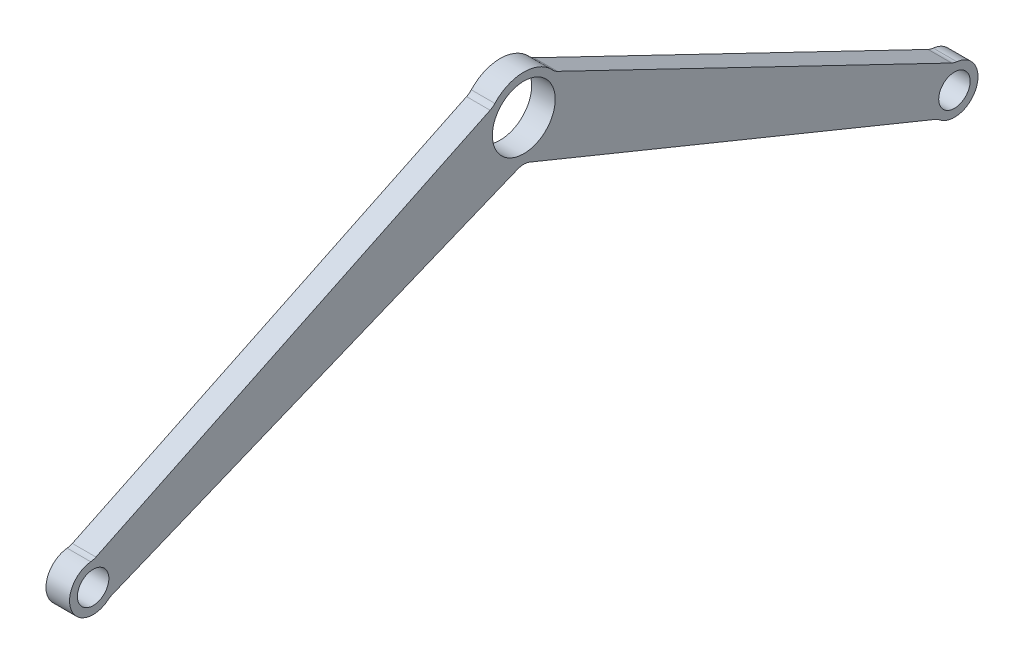
ISO-10303-21;
HEADER;
FILE_DESCRIPTION(('STEP AP214'),'2;1');
FILE_NAME('part.step','',(''),(''),'','','');
FILE_SCHEMA(('AUTOMOTIVE_DESIGN { 1 0 10303 214 1 1 1 1 }'));
ENDSEC;
DATA;
#1=APPLICATION_CONTEXT('core data for automotive mechanical design processes');
#2=APPLICATION_PROTOCOL_DEFINITION('international standard','automotive_design',2000,#1);
#3=PRODUCT_CONTEXT('',#1,'mechanical');
#4=PRODUCT('Part','Part','',(#3));
#5=PRODUCT_RELATED_PRODUCT_CATEGORY('part','',(#4));
#6=PRODUCT_DEFINITION_FORMATION('','',#4);
#7=PRODUCT_DEFINITION_CONTEXT('part definition',#1,'design');
#8=PRODUCT_DEFINITION('design','',#6,#7);
#9=PRODUCT_DEFINITION_SHAPE('','',#8);
#10=(LENGTH_UNIT() NAMED_UNIT(*) SI_UNIT(.MILLI.,.METRE.));
#11=(NAMED_UNIT(*) PLANE_ANGLE_UNIT() SI_UNIT($,.RADIAN.));
#12=(NAMED_UNIT(*) SI_UNIT($,.STERADIAN.) SOLID_ANGLE_UNIT());
#13=UNCERTAINTY_MEASURE_WITH_UNIT(LENGTH_MEASURE(1.E-05),#10,'distance_accuracy_value','');
#14=(GEOMETRIC_REPRESENTATION_CONTEXT(3) GLOBAL_UNCERTAINTY_ASSIGNED_CONTEXT((#13)) GLOBAL_UNIT_ASSIGNED_CONTEXT((#10,
#11,#12)) REPRESENTATION_CONTEXT('',''));
#15=CARTESIAN_POINT('',(0.,0.,0.));
#16=DIRECTION('',(0.,0.,1.));
#17=DIRECTION('',(1.,0.,0.));
#18=AXIS2_PLACEMENT_3D('',#15,#16,#17);
#19=CARTESIAN_POINT('',(30.,-42.8423665530146,-17.5114235797055));
#20=DIRECTION('',(0.,-0.925660483687346,-0.378355215293391));
#21=DIRECTION('',(0.,0.378355215293391,-0.925660483687346));
#22=AXIS2_PLACEMENT_3D('',#19,#20,#21);
#23=PLANE('',#22);
#24=DIRECTION('',(0.,-0.378355215293391,0.925660483687346));
#25=VECTOR('',#24,1.);
#26=CARTESIAN_POINT('',(0.,-42.8423665530146,-17.5114235797055));
#27=LINE('',#26,#25);
#28=CARTESIAN_POINT('',(0.,-53.0929843384793,7.56710430586782));
#29=VERTEX_POINT('',#28);
#30=CARTESIAN_POINT('',(0.,-264.160483712007,523.9518022392));
#31=VERTEX_POINT('',#30);
#32=EDGE_CURVE('E461',#29,#31,#27,.T.);
#33=ORIENTED_EDGE('',*,*,#32,.F.);
#34=DIRECTION('',(-1.,0.,0.));
#35=VECTOR('',#34,1.);
#36=CARTESIAN_POINT('',(30.,-53.0929843384793,7.56710430586782));
#37=LINE('',#36,#35);
#38=CARTESIAN_POINT('',(30.,-53.0929843384793,7.56710430586782));
#39=VERTEX_POINT('',#38);
#40=EDGE_CURVE('E341',#29,#39,#37,.F.);
#41=ORIENTED_EDGE('',*,*,#40,.T.);
#42=DIRECTION('',(0.,-0.378355215293391,0.925660483687346));
#43=VECTOR('',#42,1.);
#44=CARTESIAN_POINT('',(30.,-42.8423665530146,-17.5114235797055));
#45=LINE('',#44,#43);
#46=CARTESIAN_POINT('',(30.,-264.160483712007,523.9518022392));
#47=VERTEX_POINT('',#46);
#48=EDGE_CURVE('E318',#39,#47,#45,.T.);
#49=ORIENTED_EDGE('',*,*,#48,.T.);
#50=DIRECTION('',(-1.,0.,0.));
#51=VECTOR('',#50,1.);
#52=CARTESIAN_POINT('',(30.,-264.160483712007,523.9518022392));
#53=LINE('',#52,#51);
#54=EDGE_CURVE('E337',#47,#31,#53,.T.);
#55=ORIENTED_EDGE('',*,*,#54,.T.);
#56=EDGE_LOOP('',(#33,#41,#49,#55));
#57=FACE_BOUND('',#56,.T.);
#58=ADVANCED_FACE('F179',(#57),#23,.T.);
#59=CARTESIAN_POINT('',(30.,40.5827407099701,19.5493783012617));
#60=DIRECTION('',(0.,-0.900918872151872,-0.433987541066098));
#61=DIRECTION('',(0.,0.433987541066098,-0.900918872151872));
#62=AXIS2_PLACEMENT_3D('',#59,#60,#61);
#63=PLANE('',#62);
#64=DIRECTION('',(0.,-0.433987541066098,0.900918872151873));
#65=VECTOR('',#64,1.);
#66=CARTESIAN_POINT('',(0.,40.5827407099701,19.5493783012617));
#67=LINE('',#66,#65);
#68=CARTESIAN_POINT('',(0.,29.3574264870438,42.8521150674512));
#69=VERTEX_POINT('',#68);
#70=CARTESIAN_POINT('',(0.,-212.322113320347,544.556974821239));
#71=VERTEX_POINT('',#70);
#72=EDGE_CURVE('E395',#69,#71,#67,.T.);
#73=ORIENTED_EDGE('',*,*,#72,.T.);
#74=DIRECTION('',(1.,0.,0.));
#75=VECTOR('',#74,1.);
#76=CARTESIAN_POINT('',(30.,-212.322113320347,544.556974821239));
#77=LINE('',#76,#75);
#78=CARTESIAN_POINT('',(30.,-212.322113320347,544.556974821239));
#79=VERTEX_POINT('',#78);
#80=EDGE_CURVE('E195',#71,#79,#77,.T.);
#81=ORIENTED_EDGE('',*,*,#80,.T.);
#82=DIRECTION('',(0.,-0.433987541066098,0.900918872151873));
#83=VECTOR('',#82,1.);
#84=CARTESIAN_POINT('',(30.,40.5827407099701,19.5493783012617));
#85=LINE('',#84,#83);
#86=CARTESIAN_POINT('',(30.,29.3574264870438,42.8521150674512));
#87=VERTEX_POINT('',#86);
#88=EDGE_CURVE('E312',#87,#79,#85,.T.);
#89=ORIENTED_EDGE('',*,*,#88,.F.);
#90=DIRECTION('',(1.,0.,0.));
#91=VECTOR('',#90,1.);
#92=CARTESIAN_POINT('',(0.,29.3574264870438,42.8521150674512));
#93=LINE('',#92,#91);
#94=EDGE_CURVE('E357',#87,#69,#93,.F.);
#95=ORIENTED_EDGE('',*,*,#94,.T.);
#96=EDGE_LOOP('',(#73,#81,#89,#95));
#97=FACE_BOUND('',#96,.T.);
#98=ADVANCED_FACE('F406',(#97),#63,.F.);
#99=CARTESIAN_POINT('',(0.,0.,0.));
#100=DIRECTION('',(1.,0.,0.));
#101=DIRECTION('',(0.,0.,-1.));
#102=AXIS2_PLACEMENT_3D('',#99,#100,#101);
#103=PLANE('',#102);
#104=DIRECTION('',(0.,-0.378355215293391,-0.925660483687346));
#105=VECTOR('',#104,1.);
#106=CARTESIAN_POINT('',(0.,-42.8423665530146,17.5114235797055));
#107=LINE('',#106,#105);
#108=CARTESIAN_POINT('',(0.,-53.0929843384793,-7.56710430586782));
#109=VERTEX_POINT('',#108);
#110=CARTESIAN_POINT('',(0.,-264.160483712007,-523.9518022392));
#111=VERTEX_POINT('',#110);
#112=EDGE_CURVE('E307',#109,#111,#107,.T.);
#113=ORIENTED_EDGE('',*,*,#112,.F.);
#114=CARTESIAN_POINT('',(0.,-71.6061940122262,0.));
#115=DIRECTION('',(1.,0.,0.));
#116=DIRECTION('',(0.,0.,-1.));
#117=AXIS2_PLACEMENT_3D('',#114,#115,#116);
#118=CIRCLE('',#117,20.);
#119=EDGE_CURVE('E375',#109,#29,#118,.T.);
#120=ORIENTED_EDGE('',*,*,#119,.T.);
#121=ORIENTED_EDGE('',*,*,#32,.T.);
#122=CARTESIAN_POINT('',(0.,-282.673693385754,516.384697933332));
#123=DIRECTION('',(1.,0.,0.));
#124=DIRECTION('',(0.,0.,-1.));
#125=AXIS2_PLACEMENT_3D('',#122,#123,#124);
#126=CIRCLE('',#125,20.);
#127=CARTESIAN_POINT('',(0.,-267.221010369644,529.081728594224));
#128=VERTEX_POINT('',#127);
#129=EDGE_CURVE('E382',#31,#128,#126,.T.);
#130=ORIENTED_EDGE('',*,*,#129,.T.);
#131=CARTESIAN_POINT('',(0.,-244.041985845479,548.127274585561));
#132=DIRECTION('',(1.,0.,0.));
#133=DIRECTION('',(0.,0.,-1.));
#134=AXIS2_PLACEMENT_3D('',#131,#132,#133);
#135=CIRCLE('',#134,30.);
#136=CARTESIAN_POINT('',(0.,-214.199035864577,551.192945219761));
#137=VERTEX_POINT('',#136);
#138=EDGE_CURVE('E419',#137,#128,#135,.T.);
#139=ORIENTED_EDGE('',*,*,#138,.F.);
#140=CARTESIAN_POINT('',(0.,-194.303735877309,553.236725642561));
#141=DIRECTION('',(1.,0.,0.));
#142=DIRECTION('',(0.,0.,-1.));
#143=AXIS2_PLACEMENT_3D('',#140,#141,#142);
#144=CIRCLE('',#143,20.);
#145=EDGE_CURVE('E388',#137,#71,#144,.T.);
#146=ORIENTED_EDGE('',*,*,#145,.T.);
#147=ORIENTED_EDGE('',*,*,#72,.F.);
#148=CARTESIAN_POINT('',(0.,47.3758039300812,51.5318658887731));
#149=DIRECTION('',(1.,0.,0.));
#150=DIRECTION('',(0.,0.,-1.));
#151=AXIS2_PLACEMENT_3D('',#148,#149,#150);
#152=CIRCLE('',#151,20.);
#153=CARTESIAN_POINT('',(0.,33.839859950058,36.8084756348379));
#154=VERTEX_POINT('',#153);
#155=EDGE_CURVE('E188',#69,#154,#152,.T.);
#156=ORIENTED_EDGE('',*,*,#155,.T.);
#157=CARTESIAN_POINT('',(0.,0.,0.));
#158=DIRECTION('',(1.,0.,0.));
#159=DIRECTION('',(0.,0.,-1.));
#160=AXIS2_PLACEMENT_3D('',#157,#158,#159);
#161=CIRCLE('',#160,50.);
#162=CARTESIAN_POINT('',(0.,33.839859950058,-36.8084756348379));
#163=VERTEX_POINT('',#162);
#164=EDGE_CURVE('E288',#163,#154,#161,.T.);
#165=ORIENTED_EDGE('',*,*,#164,.F.);
#166=CARTESIAN_POINT('',(0.,47.3758039300812,-51.5318658887731));
#167=DIRECTION('',(1.,0.,0.));
#168=DIRECTION('',(0.,0.,-1.));
#169=AXIS2_PLACEMENT_3D('',#166,#167,#168);
#170=CIRCLE('',#169,20.);
#171=CARTESIAN_POINT('',(0.,29.3574264870438,-42.8521150674512));
#172=VERTEX_POINT('',#171);
#173=EDGE_CURVE('E281',#163,#172,#170,.T.);
#174=ORIENTED_EDGE('',*,*,#173,.T.);
#175=DIRECTION('',(0.,-0.433987541066098,-0.900918872151873));
#176=VECTOR('',#175,1.);
#177=CARTESIAN_POINT('',(0.,40.5827407099701,-19.5493783012617));
#178=LINE('',#177,#176);
#179=CARTESIAN_POINT('',(0.,-212.322113320347,-544.556974821239));
#180=VERTEX_POINT('',#179);
#181=EDGE_CURVE('E286',#172,#180,#178,.T.);
#182=ORIENTED_EDGE('',*,*,#181,.T.);
#183=CARTESIAN_POINT('',(0.,-194.303735877309,-553.236725642561));
#184=DIRECTION('',(1.,0.,0.));
#185=DIRECTION('',(0.,0.,-1.));
#186=AXIS2_PLACEMENT_3D('',#183,#184,#185);
#187=CIRCLE('',#186,20.);
#188=CARTESIAN_POINT('',(0.,-214.199035864577,-551.192945219761));
#189=VERTEX_POINT('',#188);
#190=EDGE_CURVE('E363',#180,#189,#187,.T.);
#191=ORIENTED_EDGE('',*,*,#190,.T.);
#192=CARTESIAN_POINT('',(0.,-244.041985845479,-548.127274585561));
#193=DIRECTION('',(-1.,0.,0.));
#194=DIRECTION('',(0.,0.,1.));
#195=AXIS2_PLACEMENT_3D('',#192,#193,#194);
#196=CIRCLE('',#195,30.);
#197=CARTESIAN_POINT('',(0.,-267.221010369644,-529.081728594224));
#198=VERTEX_POINT('',#197);
#199=EDGE_CURVE('E321',#189,#198,#196,.T.);
#200=ORIENTED_EDGE('',*,*,#199,.T.);
#201=CARTESIAN_POINT('',(0.,-282.673693385754,-516.384697933332));
#202=DIRECTION('',(1.,0.,0.));
#203=DIRECTION('',(0.,0.,-1.));
#204=AXIS2_PLACEMENT_3D('',#201,#202,#203);
#205=CIRCLE('',#204,20.);
#206=EDGE_CURVE('E369',#198,#111,#205,.T.);
#207=ORIENTED_EDGE('',*,*,#206,.T.);
#208=EDGE_LOOP('',(#113,#120,#121,#130,#139,#146,#147,#156,#165,#174,#182,#191,#200,#207));
#209=FACE_BOUND('',#208,.T.);
#210=CARTESIAN_POINT('',(0.,0.,0.));
#211=DIRECTION('',(1.,0.,0.));
#212=DIRECTION('',(0.,0.,-1.));
#213=AXIS2_PLACEMENT_3D('',#210,#211,#212);
#214=CIRCLE('',#213,40.);
#215=CARTESIAN_POINT('',(0.,0.,-40.));
#216=VERTEX_POINT('',#215);
#217=EDGE_CURVE('E428',#216,#216,#214,.T.);
#218=ORIENTED_EDGE('',*,*,#217,.T.);
#219=EDGE_LOOP('',(#218));
#220=FACE_BOUND('',#219,.T.);
#221=CARTESIAN_POINT('',(0.,-244.041985845479,548.127274585561));
#222=DIRECTION('',(1.,0.,0.));
#223=DIRECTION('',(0.,0.,-1.));
#224=AXIS2_PLACEMENT_3D('',#221,#222,#223);
#225=CIRCLE('',#224,20.);
#226=CARTESIAN_POINT('',(0.,-244.041985845479,528.127274585561));
#227=VERTEX_POINT('',#226);
#228=EDGE_CURVE('E431',#227,#227,#225,.T.);
#229=ORIENTED_EDGE('',*,*,#228,.T.);
#230=EDGE_LOOP('',(#229));
#231=FACE_BOUND('',#230,.T.);
#232=CARTESIAN_POINT('',(0.,-244.041985845479,-548.127274585561));
#233=DIRECTION('',(-1.,0.,0.));
#234=DIRECTION('',(0.,0.,1.));
#235=AXIS2_PLACEMENT_3D('',#232,#233,#234);
#236=CIRCLE('',#235,20.);
#237=CARTESIAN_POINT('',(0.,-244.041985845479,-528.127274585561));
#238=VERTEX_POINT('',#237);
#239=EDGE_CURVE('E439',#238,#238,#236,.T.);
#240=ORIENTED_EDGE('',*,*,#239,.F.);
#241=EDGE_LOOP('',(#240));
#242=FACE_BOUND('',#241,.T.);
#243=ADVANCED_FACE('F284',(#209,#220,#231,#242),#103,.F.);
#244=CARTESIAN_POINT('',(30.,0.,0.));
#245=DIRECTION('',(1.,0.,0.));
#246=DIRECTION('',(0.,0.,-1.));
#247=AXIS2_PLACEMENT_3D('',#244,#245,#246);
#248=PLANE('',#247);
#249=CARTESIAN_POINT('',(30.,0.,0.));
#250=DIRECTION('',(1.,0.,0.));
#251=DIRECTION('',(0.,0.,-1.));
#252=AXIS2_PLACEMENT_3D('',#249,#250,#251);
#253=CIRCLE('',#252,50.);
#254=CARTESIAN_POINT('',(30.,33.839859950058,-36.8084756348379));
#255=VERTEX_POINT('',#254);
#256=CARTESIAN_POINT('',(30.,33.839859950058,36.8084756348379));
#257=VERTEX_POINT('',#256);
#258=EDGE_CURVE('E403',#255,#257,#253,.T.);
#259=ORIENTED_EDGE('',*,*,#258,.T.);
#260=CARTESIAN_POINT('',(30.,47.3758039300812,51.5318658887731));
#261=DIRECTION('',(1.,0.,0.));
#262=DIRECTION('',(0.,0.,-1.));
#263=AXIS2_PLACEMENT_3D('',#260,#261,#262);
#264=CIRCLE('',#263,20.);
#265=EDGE_CURVE('E12',#257,#87,#264,.F.);
#266=ORIENTED_EDGE('',*,*,#265,.T.);
#267=ORIENTED_EDGE('',*,*,#88,.T.);
#268=CARTESIAN_POINT('',(30.,-194.303735877309,553.236725642561));
#269=DIRECTION('',(1.,0.,0.));
#270=DIRECTION('',(0.,0.,-1.));
#271=AXIS2_PLACEMENT_3D('',#268,#269,#270);
#272=CIRCLE('',#271,20.);
#273=CARTESIAN_POINT('',(30.,-214.199035864577,551.192945219761));
#274=VERTEX_POINT('',#273);
#275=EDGE_CURVE('E391',#79,#274,#272,.F.);
#276=ORIENTED_EDGE('',*,*,#275,.T.);
#277=CARTESIAN_POINT('',(30.,-244.041985845479,548.127274585561));
#278=DIRECTION('',(1.,0.,0.));
#279=DIRECTION('',(0.,0.,-1.));
#280=AXIS2_PLACEMENT_3D('',#277,#278,#279);
#281=CIRCLE('',#280,30.);
#282=CARTESIAN_POINT('',(30.,-267.221010369644,529.081728594224));
#283=VERTEX_POINT('',#282);
#284=EDGE_CURVE('E421',#274,#283,#281,.T.);
#285=ORIENTED_EDGE('',*,*,#284,.T.);
#286=CARTESIAN_POINT('',(30.,-282.673693385754,516.384697933332));
#287=DIRECTION('',(1.,0.,0.));
#288=DIRECTION('',(0.,0.,-1.));
#289=AXIS2_PLACEMENT_3D('',#286,#287,#288);
#290=CIRCLE('',#289,20.);
#291=EDGE_CURVE('E385',#283,#47,#290,.F.);
#292=ORIENTED_EDGE('',*,*,#291,.T.);
#293=ORIENTED_EDGE('',*,*,#48,.F.);
#294=CARTESIAN_POINT('',(30.,-71.6061940122262,0.));
#295=DIRECTION('',(1.,0.,0.));
#296=DIRECTION('',(0.,0.,-1.));
#297=AXIS2_PLACEMENT_3D('',#294,#295,#296);
#298=CIRCLE('',#297,20.);
#299=CARTESIAN_POINT('',(30.,-53.0929843384793,-7.56710430586782));
#300=VERTEX_POINT('',#299);
#301=EDGE_CURVE('E295',#39,#300,#298,.F.);
#302=ORIENTED_EDGE('',*,*,#301,.T.);
#303=DIRECTION('',(0.,-0.378355215293391,-0.925660483687346));
#304=VECTOR('',#303,1.);
#305=CARTESIAN_POINT('',(30.,-42.8423665530146,17.5114235797055));
#306=LINE('',#305,#304);
#307=CARTESIAN_POINT('',(30.,-264.160483712007,-523.9518022392));
#308=VERTEX_POINT('',#307);
#309=EDGE_CURVE('E306',#300,#308,#306,.T.);
#310=ORIENTED_EDGE('',*,*,#309,.T.);
#311=CARTESIAN_POINT('',(30.,-282.673693385754,-516.384697933332));
#312=DIRECTION('',(1.,0.,0.));
#313=DIRECTION('',(0.,0.,-1.));
#314=AXIS2_PLACEMENT_3D('',#311,#312,#313);
#315=CIRCLE('',#314,20.);
#316=CARTESIAN_POINT('',(30.,-267.221010369644,-529.081728594224));
#317=VERTEX_POINT('',#316);
#318=EDGE_CURVE('E372',#308,#317,#315,.F.);
#319=ORIENTED_EDGE('',*,*,#318,.T.);
#320=CARTESIAN_POINT('',(30.,-244.041985845479,-548.127274585561));
#321=DIRECTION('',(-1.,0.,0.));
#322=DIRECTION('',(0.,0.,1.));
#323=AXIS2_PLACEMENT_3D('',#320,#321,#322);
#324=CIRCLE('',#323,30.);
#325=CARTESIAN_POINT('',(30.,-214.199035864577,-551.192945219761));
#326=VERTEX_POINT('',#325);
#327=EDGE_CURVE('E442',#326,#317,#324,.T.);
#328=ORIENTED_EDGE('',*,*,#327,.F.);
#329=CARTESIAN_POINT('',(30.,-194.303735877309,-553.236725642561));
#330=DIRECTION('',(1.,0.,0.));
#331=DIRECTION('',(0.,0.,-1.));
#332=AXIS2_PLACEMENT_3D('',#329,#330,#331);
#333=CIRCLE('',#332,20.);
#334=CARTESIAN_POINT('',(30.,-212.322113320347,-544.556974821239));
#335=VERTEX_POINT('',#334);
#336=EDGE_CURVE('E366',#326,#335,#333,.F.);
#337=ORIENTED_EDGE('',*,*,#336,.T.);
#338=DIRECTION('',(0.,-0.433987541066098,-0.900918872151873));
#339=VECTOR('',#338,1.);
#340=CARTESIAN_POINT('',(30.,40.5827407099701,-19.5493783012617));
#341=LINE('',#340,#339);
#342=CARTESIAN_POINT('',(30.,29.3574264870438,-42.8521150674512));
#343=VERTEX_POINT('',#342);
#344=EDGE_CURVE('E459',#343,#335,#341,.T.);
#345=ORIENTED_EDGE('',*,*,#344,.F.);
#346=CARTESIAN_POINT('',(30.,47.3758039300812,-51.5318658887731));
#347=DIRECTION('',(1.,0.,0.));
#348=DIRECTION('',(0.,0.,-1.));
#349=AXIS2_PLACEMENT_3D('',#346,#347,#348);
#350=CIRCLE('',#349,20.);
#351=EDGE_CURVE('E294',#343,#255,#350,.F.);
#352=ORIENTED_EDGE('',*,*,#351,.T.);
#353=EDGE_LOOP('',(#259,#266,#267,#276,#285,#292,#293,#302,#310,#319,#328,#337,#345,#352));
#354=FACE_BOUND('',#353,.T.);
#355=CARTESIAN_POINT('',(30.,0.,0.));
#356=DIRECTION('',(1.,0.,0.));
#357=DIRECTION('',(0.,0.,-1.));
#358=AXIS2_PLACEMENT_3D('',#355,#356,#357);
#359=CIRCLE('',#358,40.);
#360=CARTESIAN_POINT('',(30.,0.,-40.));
#361=VERTEX_POINT('',#360);
#362=EDGE_CURVE('E404',#361,#361,#359,.T.);
#363=ORIENTED_EDGE('',*,*,#362,.F.);
#364=EDGE_LOOP('',(#363));
#365=FACE_BOUND('',#364,.T.);
#366=CARTESIAN_POINT('',(30.,-244.041985845479,548.127274585561));
#367=DIRECTION('',(1.,0.,0.));
#368=DIRECTION('',(0.,0.,-1.));
#369=AXIS2_PLACEMENT_3D('',#366,#367,#368);
#370=CIRCLE('',#369,20.);
#371=CARTESIAN_POINT('',(30.,-244.041985845479,528.127274585561));
#372=VERTEX_POINT('',#371);
#373=EDGE_CURVE('E424',#372,#372,#370,.T.);
#374=ORIENTED_EDGE('',*,*,#373,.F.);
#375=EDGE_LOOP('',(#374));
#376=FACE_BOUND('',#375,.T.);
#377=CARTESIAN_POINT('',(30.,-244.041985845479,-548.127274585561));
#378=DIRECTION('',(-1.,0.,0.));
#379=DIRECTION('',(0.,0.,1.));
#380=AXIS2_PLACEMENT_3D('',#377,#378,#379);
#381=CIRCLE('',#380,20.);
#382=CARTESIAN_POINT('',(30.,-244.041985845479,-528.127274585561));
#383=VERTEX_POINT('',#382);
#384=EDGE_CURVE('E435',#383,#383,#381,.T.);
#385=ORIENTED_EDGE('',*,*,#384,.T.);
#386=EDGE_LOOP('',(#385));
#387=FACE_BOUND('',#386,.T.);
#388=ADVANCED_FACE('F408',(#354,#365,#376,#387),#248,.T.);
#389=CARTESIAN_POINT('',(30.,-244.041985845479,548.127274585561));
#390=DIRECTION('',(-1.,0.,0.));
#391=DIRECTION('',(0.,0.,1.));
#392=AXIS2_PLACEMENT_3D('',#389,#390,#391);
#393=CYLINDRICAL_SURFACE('',#392,20.);
#394=ORIENTED_EDGE('',*,*,#373,.T.);
#395=EDGE_LOOP('',(#394));
#396=FACE_BOUND('',#395,.T.);
#397=ORIENTED_EDGE('',*,*,#228,.F.);
#398=EDGE_LOOP('',(#397));
#399=FACE_BOUND('',#398,.T.);
#400=ADVANCED_FACE('F492',(#396,#399),#393,.F.);
#401=CARTESIAN_POINT('',(30.,-244.041985845479,548.127274585561));
#402=DIRECTION('',(-1.,0.,0.));
#403=DIRECTION('',(0.,0.,1.));
#404=AXIS2_PLACEMENT_3D('',#401,#402,#403);
#405=CYLINDRICAL_SURFACE('',#404,30.);
#406=ORIENTED_EDGE('',*,*,#138,.T.);
#407=DIRECTION('',(-1.,0.,0.));
#408=VECTOR('',#407,1.);
#409=CARTESIAN_POINT('',(30.,-267.221010369644,529.081728594224));
#410=LINE('',#409,#408);
#411=EDGE_CURVE('E354',#128,#283,#410,.F.);
#412=ORIENTED_EDGE('',*,*,#411,.T.);
#413=ORIENTED_EDGE('',*,*,#284,.F.);
#414=DIRECTION('',(-1.,0.,0.));
#415=VECTOR('',#414,1.);
#416=CARTESIAN_POINT('',(30.,-214.199035864577,551.192945219761));
#417=LINE('',#416,#415);
#418=EDGE_CURVE('E350',#274,#137,#417,.T.);
#419=ORIENTED_EDGE('',*,*,#418,.T.);
#420=EDGE_LOOP('',(#406,#412,#413,#419));
#421=FACE_BOUND('',#420,.T.);
#422=ADVANCED_FACE('F418',(#421),#405,.T.);
#423=CARTESIAN_POINT('',(30.,-244.041985845479,-548.127274585561));
#424=DIRECTION('',(-1.,0.,0.));
#425=DIRECTION('',(0.,0.,1.));
#426=AXIS2_PLACEMENT_3D('',#423,#424,#425);
#427=CYLINDRICAL_SURFACE('',#426,20.);
#428=ORIENTED_EDGE('',*,*,#384,.F.);
#429=EDGE_LOOP('',(#428));
#430=FACE_BOUND('',#429,.T.);
#431=ORIENTED_EDGE('',*,*,#239,.T.);
#432=EDGE_LOOP('',(#431));
#433=FACE_BOUND('',#432,.T.);
#434=ADVANCED_FACE('F494',(#430,#433),#427,.F.);
#435=CARTESIAN_POINT('',(30.,-244.041985845479,-548.127274585561));
#436=DIRECTION('',(-1.,0.,0.));
#437=DIRECTION('',(0.,0.,1.));
#438=AXIS2_PLACEMENT_3D('',#435,#436,#437);
#439=CYLINDRICAL_SURFACE('',#438,30.);
#440=ORIENTED_EDGE('',*,*,#199,.F.);
#441=DIRECTION('',(-1.,0.,0.));
#442=VECTOR('',#441,1.);
#443=CARTESIAN_POINT('',(30.,-214.199035864577,-551.192945219761));
#444=LINE('',#443,#442);
#445=EDGE_CURVE('E327',#189,#326,#444,.F.);
#446=ORIENTED_EDGE('',*,*,#445,.T.);
#447=ORIENTED_EDGE('',*,*,#327,.T.);
#448=DIRECTION('',(-1.,0.,0.));
#449=VECTOR('',#448,1.);
#450=CARTESIAN_POINT('',(30.,-267.221010369644,-529.081728594224));
#451=LINE('',#450,#449);
#452=EDGE_CURVE('E316',#317,#198,#451,.T.);
#453=ORIENTED_EDGE('',*,*,#452,.T.);
#454=EDGE_LOOP('',(#440,#446,#447,#453));
#455=FACE_BOUND('',#454,.T.);
#456=ADVANCED_FACE('F455',(#455),#439,.T.);
#457=CARTESIAN_POINT('',(30.,40.5827407099701,-19.5493783012617));
#458=DIRECTION('',(0.,0.900918872151872,-0.433987541066098));
#459=DIRECTION('',(0.,0.433987541066098,0.900918872151872));
#460=AXIS2_PLACEMENT_3D('',#457,#458,#459);
#461=PLANE('',#460);
#462=ORIENTED_EDGE('',*,*,#344,.T.);
#463=DIRECTION('',(1.,0.,0.));
#464=VECTOR('',#463,1.);
#465=CARTESIAN_POINT('',(0.,-212.322113320347,-544.556974821239));
#466=LINE('',#465,#464);
#467=EDGE_CURVE('E304',#335,#180,#466,.F.);
#468=ORIENTED_EDGE('',*,*,#467,.T.);
#469=ORIENTED_EDGE('',*,*,#181,.F.);
#470=DIRECTION('',(-1.,0.,0.));
#471=VECTOR('',#470,1.);
#472=CARTESIAN_POINT('',(30.,29.3574264870438,-42.8521150674512));
#473=LINE('',#472,#471);
#474=EDGE_CURVE('E301',#172,#343,#473,.F.);
#475=ORIENTED_EDGE('',*,*,#474,.T.);
#476=EDGE_LOOP('',(#462,#468,#469,#475));
#477=FACE_BOUND('',#476,.T.);
#478=ADVANCED_FACE('F300',(#477),#461,.T.);
#479=CARTESIAN_POINT('',(30.,0.,0.));
#480=DIRECTION('',(-1.,0.,0.));
#481=DIRECTION('',(0.,0.,1.));
#482=AXIS2_PLACEMENT_3D('',#479,#480,#481);
#483=CYLINDRICAL_SURFACE('',#482,40.);
#484=ORIENTED_EDGE('',*,*,#362,.T.);
#485=EDGE_LOOP('',(#484));
#486=FACE_BOUND('',#485,.T.);
#487=ORIENTED_EDGE('',*,*,#217,.F.);
#488=EDGE_LOOP('',(#487));
#489=FACE_BOUND('',#488,.T.);
#490=ADVANCED_FACE('F482',(#486,#489),#483,.F.);
#491=CARTESIAN_POINT('',(30.,0.,0.));
#492=DIRECTION('',(-1.,0.,0.));
#493=DIRECTION('',(0.,0.,1.));
#494=AXIS2_PLACEMENT_3D('',#491,#492,#493);
#495=CYLINDRICAL_SURFACE('',#494,50.);
#496=ORIENTED_EDGE('',*,*,#258,.F.);
#497=DIRECTION('',(-1.,0.,0.));
#498=VECTOR('',#497,1.);
#499=CARTESIAN_POINT('',(30.,33.839859950058,-36.8084756348379));
#500=LINE('',#499,#498);
#501=EDGE_CURVE('E347',#255,#163,#500,.T.);
#502=ORIENTED_EDGE('',*,*,#501,.T.);
#503=ORIENTED_EDGE('',*,*,#164,.T.);
#504=DIRECTION('',(-1.,0.,0.));
#505=VECTOR('',#504,1.);
#506=CARTESIAN_POINT('',(30.,33.839859950058,36.8084756348379));
#507=LINE('',#506,#505);
#508=EDGE_CURVE('E344',#154,#257,#507,.F.);
#509=ORIENTED_EDGE('',*,*,#508,.T.);
#510=EDGE_LOOP('',(#496,#502,#503,#509));
#511=FACE_BOUND('',#510,.T.);
#512=ADVANCED_FACE('F401',(#511),#495,.T.);
#513=CARTESIAN_POINT('',(30.,-42.8423665530146,17.5114235797055));
#514=DIRECTION('',(0.,0.925660483687346,-0.378355215293391));
#515=DIRECTION('',(0.,0.378355215293391,0.925660483687346));
#516=AXIS2_PLACEMENT_3D('',#513,#514,#515);
#517=PLANE('',#516);
#518=ORIENTED_EDGE('',*,*,#112,.T.);
#519=DIRECTION('',(-1.,0.,0.));
#520=VECTOR('',#519,1.);
#521=CARTESIAN_POINT('',(30.,-264.160483712007,-523.9518022392));
#522=LINE('',#521,#520);
#523=EDGE_CURVE('E334',#111,#308,#522,.F.);
#524=ORIENTED_EDGE('',*,*,#523,.T.);
#525=ORIENTED_EDGE('',*,*,#309,.F.);
#526=DIRECTION('',(-1.,0.,0.));
#527=VECTOR('',#526,1.);
#528=CARTESIAN_POINT('',(30.,-53.0929843384793,-7.56710430586782));
#529=LINE('',#528,#527);
#530=EDGE_CURVE('E330',#300,#109,#529,.T.);
#531=ORIENTED_EDGE('',*,*,#530,.T.);
#532=EDGE_LOOP('',(#518,#524,#525,#531));
#533=FACE_BOUND('',#532,.T.);
#534=ADVANCED_FACE('F486',(#533),#517,.F.);
#535=CARTESIAN_POINT('',(30.,-194.303735877309,-553.236725642561));
#536=DIRECTION('',(-1.,0.,0.));
#537=DIRECTION('',(0.,0.,1.));
#538=AXIS2_PLACEMENT_3D('',#535,#536,#537);
#539=CYLINDRICAL_SURFACE('',#538,20.);
#540=ORIENTED_EDGE('',*,*,#336,.F.);
#541=ORIENTED_EDGE('',*,*,#445,.F.);
#542=ORIENTED_EDGE('',*,*,#190,.F.);
#543=ORIENTED_EDGE('',*,*,#467,.F.);
#544=EDGE_LOOP('',(#540,#541,#542,#543));
#545=FACE_BOUND('',#544,.T.);
#546=ADVANCED_FACE('F458',(#545),#539,.F.);
#547=CARTESIAN_POINT('',(30.,-282.673693385754,-516.384697933332));
#548=DIRECTION('',(-1.,0.,0.));
#549=DIRECTION('',(0.,0.,1.));
#550=AXIS2_PLACEMENT_3D('',#547,#548,#549);
#551=CYLINDRICAL_SURFACE('',#550,20.);
#552=ORIENTED_EDGE('',*,*,#318,.F.);
#553=ORIENTED_EDGE('',*,*,#523,.F.);
#554=ORIENTED_EDGE('',*,*,#206,.F.);
#555=ORIENTED_EDGE('',*,*,#452,.F.);
#556=EDGE_LOOP('',(#552,#553,#554,#555));
#557=FACE_BOUND('',#556,.T.);
#558=ADVANCED_FACE('F497',(#557),#551,.F.);
#559=CARTESIAN_POINT('',(30.,-71.6061940122262,0.));
#560=DIRECTION('',(-1.,0.,0.));
#561=DIRECTION('',(0.,0.,1.));
#562=AXIS2_PLACEMENT_3D('',#559,#560,#561);
#563=CYLINDRICAL_SURFACE('',#562,20.);
#564=ORIENTED_EDGE('',*,*,#301,.F.);
#565=ORIENTED_EDGE('',*,*,#40,.F.);
#566=ORIENTED_EDGE('',*,*,#119,.F.);
#567=ORIENTED_EDGE('',*,*,#530,.F.);
#568=EDGE_LOOP('',(#564,#565,#566,#567));
#569=FACE_BOUND('',#568,.T.);
#570=ADVANCED_FACE('F530',(#569),#563,.F.);
#571=CARTESIAN_POINT('',(30.,47.3758039300812,-51.5318658887731));
#572=DIRECTION('',(-1.,0.,0.));
#573=DIRECTION('',(0.,0.,1.));
#574=AXIS2_PLACEMENT_3D('',#571,#572,#573);
#575=CYLINDRICAL_SURFACE('',#574,20.);
#576=ORIENTED_EDGE('',*,*,#351,.F.);
#577=ORIENTED_EDGE('',*,*,#474,.F.);
#578=ORIENTED_EDGE('',*,*,#173,.F.);
#579=ORIENTED_EDGE('',*,*,#501,.F.);
#580=EDGE_LOOP('',(#576,#577,#578,#579));
#581=FACE_BOUND('',#580,.T.);
#582=ADVANCED_FACE('F310',(#581),#575,.F.);
#583=CARTESIAN_POINT('',(30.,-282.673693385754,516.384697933332));
#584=DIRECTION('',(-1.,0.,0.));
#585=DIRECTION('',(0.,0.,1.));
#586=AXIS2_PLACEMENT_3D('',#583,#584,#585);
#587=CYLINDRICAL_SURFACE('',#586,20.);
#588=ORIENTED_EDGE('',*,*,#291,.F.);
#589=ORIENTED_EDGE('',*,*,#411,.F.);
#590=ORIENTED_EDGE('',*,*,#129,.F.);
#591=ORIENTED_EDGE('',*,*,#54,.F.);
#592=EDGE_LOOP('',(#588,#589,#590,#591));
#593=FACE_BOUND('',#592,.T.);
#594=ADVANCED_FACE('F537',(#593),#587,.F.);
#595=CARTESIAN_POINT('',(30.,-194.303735877309,553.236725642561));
#596=DIRECTION('',(-1.,0.,0.));
#597=DIRECTION('',(0.,0.,1.));
#598=AXIS2_PLACEMENT_3D('',#595,#596,#597);
#599=CYLINDRICAL_SURFACE('',#598,20.);
#600=ORIENTED_EDGE('',*,*,#275,.F.);
#601=ORIENTED_EDGE('',*,*,#80,.F.);
#602=ORIENTED_EDGE('',*,*,#145,.F.);
#603=ORIENTED_EDGE('',*,*,#418,.F.);
#604=EDGE_LOOP('',(#600,#601,#602,#603));
#605=FACE_BOUND('',#604,.T.);
#606=ADVANCED_FACE('F414',(#605),#599,.F.);
#607=CARTESIAN_POINT('',(30.,47.3758039300812,51.5318658887731));
#608=DIRECTION('',(-1.,0.,0.));
#609=DIRECTION('',(0.,0.,1.));
#610=AXIS2_PLACEMENT_3D('',#607,#608,#609);
#611=CYLINDRICAL_SURFACE('',#610,20.);
#612=ORIENTED_EDGE('',*,*,#265,.F.);
#613=ORIENTED_EDGE('',*,*,#508,.F.);
#614=ORIENTED_EDGE('',*,*,#155,.F.);
#615=ORIENTED_EDGE('',*,*,#94,.F.);
#616=EDGE_LOOP('',(#612,#613,#614,#615));
#617=FACE_BOUND('',#616,.T.);
#618=ADVANCED_FACE('F181',(#617),#611,.F.);
#619=CLOSED_SHELL('',(#58,#98,#243,#388,#400,#422,#434,#456,#478,#490,#512,#534,#546,#558,#570,
#582,#594,#606,#618));
#620=MANIFOLD_SOLID_BREP('B2',#619);
#621=ADVANCED_BREP_SHAPE_REPRESENTATION('',(#18,#620),#14);
#622=SHAPE_DEFINITION_REPRESENTATION(#9,#621);
ENDSEC;
END-ISO-10303-21;
